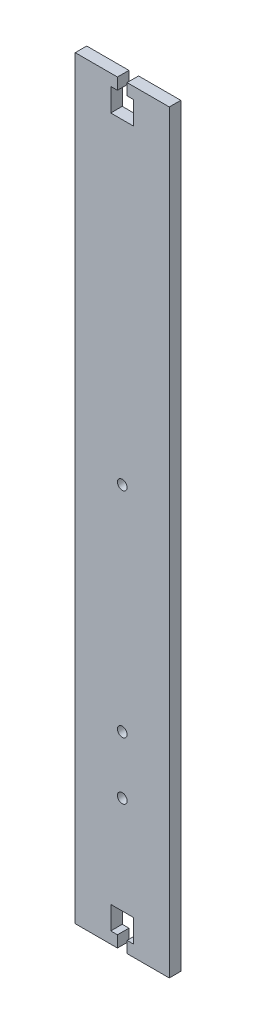
ISO-10303-21;
HEADER;
FILE_DESCRIPTION(('STEP AP214'),'2;1');
FILE_NAME('part.step','',(''),(''),'','','');
FILE_SCHEMA(('AUTOMOTIVE_DESIGN { 1 0 10303 214 1 1 1 1 }'));
ENDSEC;
DATA;
#1=APPLICATION_CONTEXT('core data for automotive mechanical design processes');
#2=APPLICATION_PROTOCOL_DEFINITION('international standard','automotive_design',2000,#1);
#3=PRODUCT_CONTEXT('',#1,'mechanical');
#4=PRODUCT('Part','Part','',(#3));
#5=PRODUCT_RELATED_PRODUCT_CATEGORY('part','',(#4));
#6=PRODUCT_DEFINITION_FORMATION('','',#4);
#7=PRODUCT_DEFINITION_CONTEXT('part definition',#1,'design');
#8=PRODUCT_DEFINITION('design','',#6,#7);
#9=PRODUCT_DEFINITION_SHAPE('','',#8);
#10=(LENGTH_UNIT() NAMED_UNIT(*) SI_UNIT(.MILLI.,.METRE.));
#11=(NAMED_UNIT(*) PLANE_ANGLE_UNIT() SI_UNIT($,.RADIAN.));
#12=(NAMED_UNIT(*) SI_UNIT($,.STERADIAN.) SOLID_ANGLE_UNIT());
#13=UNCERTAINTY_MEASURE_WITH_UNIT(LENGTH_MEASURE(1.E-05),#10,'distance_accuracy_value','');
#14=(GEOMETRIC_REPRESENTATION_CONTEXT(3) GLOBAL_UNCERTAINTY_ASSIGNED_CONTEXT((#13)) GLOBAL_UNIT_ASSIGNED_CONTEXT((#10,
#11,#12)) REPRESENTATION_CONTEXT('',''));
#15=CARTESIAN_POINT('',(0.,0.,0.));
#16=DIRECTION('',(0.,0.,1.));
#17=DIRECTION('',(1.,0.,0.));
#18=AXIS2_PLACEMENT_3D('',#15,#16,#17);
#19=CARTESIAN_POINT('',(20.445,-164.,5.));
#20=DIRECTION('',(0.,1.,0.));
#21=DIRECTION('',(0.,0.,1.));
#22=AXIS2_PLACEMENT_3D('',#19,#20,#21);
#23=PLANE('',#22);
#24=DIRECTION('',(1.,0.,0.));
#25=VECTOR('',#24,1.);
#26=CARTESIAN_POINT('',(20.445,-164.,0.));
#27=LINE('',#26,#25);
#28=CARTESIAN_POINT('',(-20.445,-164.,0.));
#29=VERTEX_POINT('',#28);
#30=CARTESIAN_POINT('',(-2.1,-164.,0.));
#31=VERTEX_POINT('',#30);
#32=EDGE_CURVE('E220',#29,#31,#27,.T.);
#33=ORIENTED_EDGE('',*,*,#32,.T.);
#34=DIRECTION('',(0.,0.,1.));
#35=VECTOR('',#34,1.);
#36=CARTESIAN_POINT('',(-2.1,-164.,-5.));
#37=LINE('',#36,#35);
#38=CARTESIAN_POINT('',(-2.1,-164.,5.));
#39=VERTEX_POINT('',#38);
#40=EDGE_CURVE('E292',#31,#39,#37,.T.);
#41=ORIENTED_EDGE('',*,*,#40,.T.);
#42=DIRECTION('',(1.,0.,0.));
#43=VECTOR('',#42,1.);
#44=CARTESIAN_POINT('',(20.445,-164.,5.));
#45=LINE('',#44,#43);
#46=CARTESIAN_POINT('',(-20.445,-164.,5.));
#47=VERTEX_POINT('',#46);
#48=EDGE_CURVE('E199',#47,#39,#45,.T.);
#49=ORIENTED_EDGE('',*,*,#48,.F.);
#50=DIRECTION('',(0.,0.,-1.));
#51=VECTOR('',#50,1.);
#52=CARTESIAN_POINT('',(-20.445,-164.,5.));
#53=LINE('',#52,#51);
#54=EDGE_CURVE('E234',#47,#29,#53,.T.);
#55=ORIENTED_EDGE('',*,*,#54,.T.);
#56=EDGE_LOOP('',(#33,#41,#49,#55));
#57=FACE_BOUND('',#56,.T.);
#58=ADVANCED_FACE('F37',(#57),#23,.F.);
#59=CARTESIAN_POINT('',(20.445,164.,5.));
#60=DIRECTION('',(0.,-1.,0.));
#61=DIRECTION('',(1.,0.,0.));
#62=AXIS2_PLACEMENT_3D('',#59,#60,#61);
#63=PLANE('',#62);
#64=DIRECTION('',(-1.,0.,0.));
#65=VECTOR('',#64,1.);
#66=CARTESIAN_POINT('',(20.445,164.,0.));
#67=LINE('',#66,#65);
#68=CARTESIAN_POINT('',(20.445,164.,0.));
#69=VERTEX_POINT('',#68);
#70=CARTESIAN_POINT('',(2.10000000000027,164.,0.));
#71=VERTEX_POINT('',#70);
#72=EDGE_CURVE('E205',#69,#71,#67,.T.);
#73=ORIENTED_EDGE('',*,*,#72,.T.);
#74=DIRECTION('',(0.,0.,1.));
#75=VECTOR('',#74,1.);
#76=CARTESIAN_POINT('',(2.10000000000027,164.,-5.));
#77=LINE('',#76,#75);
#78=CARTESIAN_POINT('',(2.10000000000027,164.,5.));
#79=VERTEX_POINT('',#78);
#80=EDGE_CURVE('E193',#71,#79,#77,.T.);
#81=ORIENTED_EDGE('',*,*,#80,.T.);
#82=DIRECTION('',(-1.,0.,0.));
#83=VECTOR('',#82,1.);
#84=CARTESIAN_POINT('',(20.445,164.,5.));
#85=LINE('',#84,#83);
#86=CARTESIAN_POINT('',(20.445,164.,5.));
#87=VERTEX_POINT('',#86);
#88=EDGE_CURVE('E211',#87,#79,#85,.T.);
#89=ORIENTED_EDGE('',*,*,#88,.F.);
#90=DIRECTION('',(0.,0.,-1.));
#91=VECTOR('',#90,1.);
#92=CARTESIAN_POINT('',(20.445,164.,5.));
#93=LINE('',#92,#91);
#94=EDGE_CURVE('E230',#87,#69,#93,.T.);
#95=ORIENTED_EDGE('',*,*,#94,.T.);
#96=EDGE_LOOP('',(#73,#81,#89,#95));
#97=FACE_BOUND('',#96,.T.);
#98=ADVANCED_FACE('F391',(#97),#63,.F.);
#99=CARTESIAN_POINT('',(-20.445,-164.,5.));
#100=DIRECTION('',(1.,0.,0.));
#101=DIRECTION('',(0.,0.,-1.));
#102=AXIS2_PLACEMENT_3D('',#99,#100,#101);
#103=PLANE('',#102);
#104=DIRECTION('',(0.,-1.,0.));
#105=VECTOR('',#104,1.);
#106=CARTESIAN_POINT('',(-20.445,-164.,0.));
#107=LINE('',#106,#105);
#108=CARTESIAN_POINT('',(-20.445,164.,0.));
#109=VERTEX_POINT('',#108);
#110=EDGE_CURVE('E215',#109,#29,#107,.T.);
#111=ORIENTED_EDGE('',*,*,#110,.T.);
#112=ORIENTED_EDGE('',*,*,#54,.F.);
#113=DIRECTION('',(0.,-1.,0.));
#114=VECTOR('',#113,1.);
#115=CARTESIAN_POINT('',(-20.445,-164.,5.));
#116=LINE('',#115,#114);
#117=CARTESIAN_POINT('',(-20.445,164.,5.));
#118=VERTEX_POINT('',#117);
#119=EDGE_CURVE('E200',#118,#47,#116,.T.);
#120=ORIENTED_EDGE('',*,*,#119,.F.);
#121=DIRECTION('',(0.,0.,-1.));
#122=VECTOR('',#121,1.);
#123=CARTESIAN_POINT('',(-20.445,164.,5.));
#124=LINE('',#123,#122);
#125=EDGE_CURVE('E214',#118,#109,#124,.T.);
#126=ORIENTED_EDGE('',*,*,#125,.T.);
#127=EDGE_LOOP('',(#111,#112,#120,#126));
#128=FACE_BOUND('',#127,.T.);
#129=ADVANCED_FACE('F39',(#128),#103,.F.);
#130=CARTESIAN_POINT('',(2.10000000000003,-164.,5.));
#131=VERTEX_POINT('',#130);
#132=CARTESIAN_POINT('',(20.445,-164.,5.));
#133=VERTEX_POINT('',#132);
#134=EDGE_CURVE('E188',#131,#133,#45,.T.);
#135=ORIENTED_EDGE('',*,*,#134,.F.);
#136=DIRECTION('',(0.,0.,1.));
#137=VECTOR('',#136,1.);
#138=CARTESIAN_POINT('',(2.10000000000003,-164.,-5.));
#139=LINE('',#138,#137);
#140=CARTESIAN_POINT('',(2.10000000000003,-164.,0.));
#141=VERTEX_POINT('',#140);
#142=EDGE_CURVE('E172',#141,#131,#139,.T.);
#143=ORIENTED_EDGE('',*,*,#142,.F.);
#144=CARTESIAN_POINT('',(20.445,-164.,0.));
#145=VERTEX_POINT('',#144);
#146=EDGE_CURVE('E218',#141,#145,#27,.T.);
#147=ORIENTED_EDGE('',*,*,#146,.T.);
#148=DIRECTION('',(0.,0.,-1.));
#149=VECTOR('',#148,1.);
#150=CARTESIAN_POINT('',(20.445,-164.,5.));
#151=LINE('',#150,#149);
#152=EDGE_CURVE('E197',#133,#145,#151,.T.);
#153=ORIENTED_EDGE('',*,*,#152,.F.);
#154=EDGE_LOOP('',(#135,#143,#147,#153));
#155=FACE_BOUND('',#154,.T.);
#156=ADVANCED_FACE('F195',(#155),#23,.F.);
#157=CARTESIAN_POINT('',(20.445,-164.,5.));
#158=DIRECTION('',(-1.,0.,0.));
#159=DIRECTION('',(0.,0.,1.));
#160=AXIS2_PLACEMENT_3D('',#157,#158,#159);
#161=PLANE('',#160);
#162=DIRECTION('',(0.,1.,0.));
#163=VECTOR('',#162,1.);
#164=CARTESIAN_POINT('',(20.445,-164.,0.));
#165=LINE('',#164,#163);
#166=EDGE_CURVE('E223',#145,#69,#165,.T.);
#167=ORIENTED_EDGE('',*,*,#166,.T.);
#168=ORIENTED_EDGE('',*,*,#94,.F.);
#169=DIRECTION('',(0.,1.,0.));
#170=VECTOR('',#169,1.);
#171=CARTESIAN_POINT('',(20.445,-164.,5.));
#172=LINE('',#171,#170);
#173=EDGE_CURVE('E203',#133,#87,#172,.T.);
#174=ORIENTED_EDGE('',*,*,#173,.F.);
#175=ORIENTED_EDGE('',*,*,#152,.T.);
#176=EDGE_LOOP('',(#167,#168,#174,#175));
#177=FACE_BOUND('',#176,.T.);
#178=ADVANCED_FACE('F400',(#177),#161,.F.);
#179=CARTESIAN_POINT('',(-2.09999999999976,164.,5.));
#180=VERTEX_POINT('',#179);
#181=EDGE_CURVE('E210',#180,#118,#85,.T.);
#182=ORIENTED_EDGE('',*,*,#181,.F.);
#183=DIRECTION('',(0.,0.,1.));
#184=VECTOR('',#183,1.);
#185=CARTESIAN_POINT('',(-2.09999999999976,164.,-5.));
#186=LINE('',#185,#184);
#187=CARTESIAN_POINT('',(-2.09999999999976,164.,0.));
#188=VERTEX_POINT('',#187);
#189=EDGE_CURVE('E322',#188,#180,#186,.T.);
#190=ORIENTED_EDGE('',*,*,#189,.F.);
#191=EDGE_CURVE('E225',#188,#109,#67,.T.);
#192=ORIENTED_EDGE('',*,*,#191,.T.);
#193=ORIENTED_EDGE('',*,*,#125,.F.);
#194=EDGE_LOOP('',(#182,#190,#192,#193));
#195=FACE_BOUND('',#194,.T.);
#196=ADVANCED_FACE('F376',(#195),#63,.F.);
#197=CARTESIAN_POINT('',(0.,0.,5.));
#198=DIRECTION('',(0.,0.,1.));
#199=DIRECTION('',(1.,0.,0.));
#200=AXIS2_PLACEMENT_3D('',#197,#198,#199);
#201=PLANE('',#200);
#202=CARTESIAN_POINT('',(0.,11.5000000000001,5.));
#203=DIRECTION('',(0.,0.,1.));
#204=DIRECTION('',(1.,0.,0.));
#205=AXIS2_PLACEMENT_3D('',#202,#203,#204);
#206=CIRCLE('',#205,2.1);
#207=CARTESIAN_POINT('',(2.10000000000001,11.5000000000001,5.));
#208=VERTEX_POINT('',#207);
#209=EDGE_CURVE('E359',#208,#208,#206,.T.);
#210=ORIENTED_EDGE('',*,*,#209,.F.);
#211=EDGE_LOOP('',(#210));
#212=FACE_BOUND('',#211,.T.);
#213=CARTESIAN_POINT('',(0.,-106.5,5.));
#214=DIRECTION('',(0.,0.,1.));
#215=DIRECTION('',(1.,0.,0.));
#216=AXIS2_PLACEMENT_3D('',#213,#214,#215);
#217=CIRCLE('',#216,2.1);
#218=CARTESIAN_POINT('',(2.10000000000002,-106.5,5.));
#219=VERTEX_POINT('',#218);
#220=EDGE_CURVE('E353',#219,#219,#217,.T.);
#221=ORIENTED_EDGE('',*,*,#220,.F.);
#222=EDGE_LOOP('',(#221));
#223=FACE_BOUND('',#222,.T.);
#224=DIRECTION('',(0.,-1.,0.));
#225=VECTOR('',#224,1.);
#226=CARTESIAN_POINT('',(-2.1,-164.,5.));
#227=LINE('',#226,#225);
#228=CARTESIAN_POINT('',(-2.1,-159.,5.));
#229=VERTEX_POINT('',#228);
#230=EDGE_CURVE('E182',#229,#39,#227,.T.);
#231=ORIENTED_EDGE('',*,*,#230,.F.);
#232=DIRECTION('',(1.,0.,0.));
#233=VECTOR('',#232,1.);
#234=CARTESIAN_POINT('',(-2.1,-159.,5.));
#235=LINE('',#234,#233);
#236=CARTESIAN_POINT('',(-5.,-159.,5.));
#237=VERTEX_POINT('',#236);
#238=EDGE_CURVE('E343',#237,#229,#235,.T.);
#239=ORIENTED_EDGE('',*,*,#238,.F.);
#240=DIRECTION('',(0.,-1.,0.));
#241=VECTOR('',#240,1.);
#242=CARTESIAN_POINT('',(-5.,-159.,5.));
#243=LINE('',#242,#241);
#244=CARTESIAN_POINT('',(-5.,-149.,5.));
#245=VERTEX_POINT('',#244);
#246=EDGE_CURVE('E288',#245,#237,#243,.T.);
#247=ORIENTED_EDGE('',*,*,#246,.F.);
#248=DIRECTION('',(-1.,0.,0.));
#249=VECTOR('',#248,1.);
#250=CARTESIAN_POINT('',(-5.,-149.,5.));
#251=LINE('',#250,#249);
#252=CARTESIAN_POINT('',(5.00000000000001,-149.,5.));
#253=VERTEX_POINT('',#252);
#254=EDGE_CURVE('E346',#253,#245,#251,.T.);
#255=ORIENTED_EDGE('',*,*,#254,.F.);
#256=DIRECTION('',(0.,1.,0.));
#257=VECTOR('',#256,1.);
#258=CARTESIAN_POINT('',(5.00000000000002,-159.,5.));
#259=LINE('',#258,#257);
#260=CARTESIAN_POINT('',(5.00000000000002,-159.,5.));
#261=VERTEX_POINT('',#260);
#262=EDGE_CURVE('E349',#261,#253,#259,.T.);
#263=ORIENTED_EDGE('',*,*,#262,.F.);
#264=DIRECTION('',(1.,0.,0.));
#265=VECTOR('',#264,1.);
#266=CARTESIAN_POINT('',(2.10000000000002,-159.,5.));
#267=LINE('',#266,#265);
#268=CARTESIAN_POINT('',(2.10000000000002,-159.,5.));
#269=VERTEX_POINT('',#268);
#270=EDGE_CURVE('E192',#269,#261,#267,.T.);
#271=ORIENTED_EDGE('',*,*,#270,.F.);
#272=DIRECTION('',(0.,1.,0.));
#273=VECTOR('',#272,1.);
#274=CARTESIAN_POINT('',(2.10000000000003,-164.,5.));
#275=LINE('',#274,#273);
#276=EDGE_CURVE('E175',#131,#269,#275,.T.);
#277=ORIENTED_EDGE('',*,*,#276,.F.);
#278=ORIENTED_EDGE('',*,*,#134,.T.);
#279=ORIENTED_EDGE('',*,*,#173,.T.);
#280=ORIENTED_EDGE('',*,*,#88,.T.);
#281=DIRECTION('',(0.,1.,0.));
#282=VECTOR('',#281,1.);
#283=CARTESIAN_POINT('',(2.10000000000027,164.,5.));
#284=LINE('',#283,#282);
#285=CARTESIAN_POINT('',(2.10000000000026,159.,5.));
#286=VERTEX_POINT('',#285);
#287=EDGE_CURVE('E320',#286,#79,#284,.T.);
#288=ORIENTED_EDGE('',*,*,#287,.F.);
#289=DIRECTION('',(-1.,0.,0.));
#290=VECTOR('',#289,1.);
#291=CARTESIAN_POINT('',(2.10000000000026,159.,5.));
#292=LINE('',#291,#290);
#293=CARTESIAN_POINT('',(5.00000000000026,159.,5.));
#294=VERTEX_POINT('',#293);
#295=EDGE_CURVE('E317',#294,#286,#292,.T.);
#296=ORIENTED_EDGE('',*,*,#295,.F.);
#297=DIRECTION('',(0.,1.,0.));
#298=VECTOR('',#297,1.);
#299=CARTESIAN_POINT('',(5.00000000000026,159.,5.));
#300=LINE('',#299,#298);
#301=CARTESIAN_POINT('',(5.00000000000024,149.,5.));
#302=VERTEX_POINT('',#301);
#303=EDGE_CURVE('E314',#302,#294,#300,.T.);
#304=ORIENTED_EDGE('',*,*,#303,.F.);
#305=DIRECTION('',(1.,0.,0.));
#306=VECTOR('',#305,1.);
#307=CARTESIAN_POINT('',(-4.99999999999978,149.,5.));
#308=LINE('',#307,#306);
#309=CARTESIAN_POINT('',(-4.99999999999978,149.,5.));
#310=VERTEX_POINT('',#309);
#311=EDGE_CURVE('E311',#310,#302,#308,.T.);
#312=ORIENTED_EDGE('',*,*,#311,.F.);
#313=DIRECTION('',(0.,-1.,0.));
#314=VECTOR('',#313,1.);
#315=CARTESIAN_POINT('',(-4.99999999999976,159.,5.));
#316=LINE('',#315,#314);
#317=CARTESIAN_POINT('',(-4.99999999999976,159.,5.));
#318=VERTEX_POINT('',#317);
#319=EDGE_CURVE('E308',#318,#310,#316,.T.);
#320=ORIENTED_EDGE('',*,*,#319,.F.);
#321=DIRECTION('',(-1.,0.,0.));
#322=VECTOR('',#321,1.);
#323=CARTESIAN_POINT('',(-2.09999999999976,159.,5.));
#324=LINE('',#323,#322);
#325=CARTESIAN_POINT('',(-2.09999999999976,159.,5.));
#326=VERTEX_POINT('',#325);
#327=EDGE_CURVE('E304',#326,#318,#324,.T.);
#328=ORIENTED_EDGE('',*,*,#327,.F.);
#329=DIRECTION('',(0.,-1.,0.));
#330=VECTOR('',#329,1.);
#331=CARTESIAN_POINT('',(-2.09999999999976,164.,5.));
#332=LINE('',#331,#330);
#333=EDGE_CURVE('E302',#180,#326,#332,.T.);
#334=ORIENTED_EDGE('',*,*,#333,.F.);
#335=ORIENTED_EDGE('',*,*,#181,.T.);
#336=ORIENTED_EDGE('',*,*,#119,.T.);
#337=ORIENTED_EDGE('',*,*,#48,.T.);
#338=EDGE_LOOP('',(#231,#239,#247,#255,#263,#271,#277,#278,#279,#280,#288,#296,#304,#312,#320,
#328,#334,#335,#336,#337));
#339=FACE_BOUND('',#338,.T.);
#340=CARTESIAN_POINT('',(0.,-81.5,5.));
#341=DIRECTION('',(0.,0.,1.));
#342=DIRECTION('',(1.,0.,0.));
#343=AXIS2_PLACEMENT_3D('',#340,#341,#342);
#344=CIRCLE('',#343,2.1);
#345=CARTESIAN_POINT('',(2.10000000000002,-81.5,5.));
#346=VERTEX_POINT('',#345);
#347=EDGE_CURVE('E240',#346,#346,#344,.T.);
#348=ORIENTED_EDGE('',*,*,#347,.F.);
#349=EDGE_LOOP('',(#348));
#350=FACE_BOUND('',#349,.T.);
#351=ADVANCED_FACE('F186',(#212,#223,#339,#350),#201,.T.);
#352=CARTESIAN_POINT('',(0.,0.,0.));
#353=DIRECTION('',(0.,0.,1.));
#354=DIRECTION('',(1.,0.,0.));
#355=AXIS2_PLACEMENT_3D('',#352,#353,#354);
#356=PLANE('',#355);
#357=CARTESIAN_POINT('',(0.,11.5000000000001,0.));
#358=DIRECTION('',(0.,0.,1.));
#359=DIRECTION('',(1.,0.,0.));
#360=AXIS2_PLACEMENT_3D('',#357,#358,#359);
#361=CIRCLE('',#360,2.1);
#362=CARTESIAN_POINT('',(2.10000000000001,11.5000000000001,0.));
#363=VERTEX_POINT('',#362);
#364=EDGE_CURVE('E356',#363,#363,#361,.T.);
#365=ORIENTED_EDGE('',*,*,#364,.T.);
#366=EDGE_LOOP('',(#365));
#367=FACE_BOUND('',#366,.T.);
#368=CARTESIAN_POINT('',(0.,-106.5,0.));
#369=DIRECTION('',(0.,0.,1.));
#370=DIRECTION('',(1.,0.,0.));
#371=AXIS2_PLACEMENT_3D('',#368,#369,#370);
#372=CIRCLE('',#371,2.1);
#373=CARTESIAN_POINT('',(2.10000000000002,-106.5,0.));
#374=VERTEX_POINT('',#373);
#375=EDGE_CURVE('E305',#374,#374,#372,.T.);
#376=ORIENTED_EDGE('',*,*,#375,.T.);
#377=EDGE_LOOP('',(#376));
#378=FACE_BOUND('',#377,.T.);
#379=CARTESIAN_POINT('',(0.,-81.5,0.));
#380=DIRECTION('',(0.,0.,1.));
#381=DIRECTION('',(1.,0.,0.));
#382=AXIS2_PLACEMENT_3D('',#379,#380,#381);
#383=CIRCLE('',#382,2.1);
#384=CARTESIAN_POINT('',(2.10000000000002,-81.5,0.));
#385=VERTEX_POINT('',#384);
#386=EDGE_CURVE('E219',#385,#385,#383,.T.);
#387=ORIENTED_EDGE('',*,*,#386,.T.);
#388=EDGE_LOOP('',(#387));
#389=FACE_BOUND('',#388,.T.);
#390=DIRECTION('',(1.,0.,0.));
#391=VECTOR('',#390,1.);
#392=CARTESIAN_POINT('',(0.,-159.,0.));
#393=LINE('',#392,#391);
#394=CARTESIAN_POINT('',(-5.,-159.,0.));
#395=VERTEX_POINT('',#394);
#396=CARTESIAN_POINT('',(-2.1,-159.,0.));
#397=VERTEX_POINT('',#396);
#398=EDGE_CURVE('E45',#395,#397,#393,.T.);
#399=ORIENTED_EDGE('',*,*,#398,.T.);
#400=DIRECTION('',(0.,-1.,0.));
#401=VECTOR('',#400,1.);
#402=CARTESIAN_POINT('',(-2.1,0.,0.));
#403=LINE('',#402,#401);
#404=EDGE_CURVE('E11',#397,#31,#403,.T.);
#405=ORIENTED_EDGE('',*,*,#404,.T.);
#406=ORIENTED_EDGE('',*,*,#32,.F.);
#407=ORIENTED_EDGE('',*,*,#110,.F.);
#408=ORIENTED_EDGE('',*,*,#191,.F.);
#409=DIRECTION('',(0.,-1.,0.));
#410=VECTOR('',#409,1.);
#411=CARTESIAN_POINT('',(-2.09999999999998,0.,0.));
#412=LINE('',#411,#410);
#413=CARTESIAN_POINT('',(-2.09999999999976,159.,0.));
#414=VERTEX_POINT('',#413);
#415=EDGE_CURVE('E237',#188,#414,#412,.T.);
#416=ORIENTED_EDGE('',*,*,#415,.T.);
#417=DIRECTION('',(-1.,0.,0.));
#418=VECTOR('',#417,1.);
#419=CARTESIAN_POINT('',(0.,159.,0.));
#420=LINE('',#419,#418);
#421=CARTESIAN_POINT('',(-4.99999999999976,159.,0.));
#422=VERTEX_POINT('',#421);
#423=EDGE_CURVE('E243',#414,#422,#420,.T.);
#424=ORIENTED_EDGE('',*,*,#423,.T.);
#425=DIRECTION('',(0.,-1.,0.));
#426=VECTOR('',#425,1.);
#427=CARTESIAN_POINT('',(-4.99999999999998,0.,0.));
#428=LINE('',#427,#426);
#429=CARTESIAN_POINT('',(-4.99999999999978,149.,0.));
#430=VERTEX_POINT('',#429);
#431=EDGE_CURVE('E246',#422,#430,#428,.T.);
#432=ORIENTED_EDGE('',*,*,#431,.T.);
#433=DIRECTION('',(1.,0.,0.));
#434=VECTOR('',#433,1.);
#435=CARTESIAN_POINT('',(8.2711615334574E-13,149.,0.));
#436=LINE('',#435,#434);
#437=CARTESIAN_POINT('',(5.00000000000024,149.,0.));
#438=VERTEX_POINT('',#437);
#439=EDGE_CURVE('E249',#430,#438,#436,.T.);
#440=ORIENTED_EDGE('',*,*,#439,.T.);
#441=DIRECTION('',(0.,1.,0.));
#442=VECTOR('',#441,1.);
#443=CARTESIAN_POINT('',(4.9999999999999,0.,0.));
#444=LINE('',#443,#442);
#445=CARTESIAN_POINT('',(5.00000000000026,159.,0.));
#446=VERTEX_POINT('',#445);
#447=EDGE_CURVE('E252',#438,#446,#444,.T.);
#448=ORIENTED_EDGE('',*,*,#447,.T.);
#449=DIRECTION('',(-1.,0.,0.));
#450=VECTOR('',#449,1.);
#451=CARTESIAN_POINT('',(0.,159.,0.));
#452=LINE('',#451,#450);
#453=CARTESIAN_POINT('',(2.10000000000026,159.,0.));
#454=VERTEX_POINT('',#453);
#455=EDGE_CURVE('E255',#446,#454,#452,.T.);
#456=ORIENTED_EDGE('',*,*,#455,.T.);
#457=DIRECTION('',(0.,1.,0.));
#458=VECTOR('',#457,1.);
#459=CARTESIAN_POINT('',(2.0999999999999,0.,0.));
#460=LINE('',#459,#458);
#461=EDGE_CURVE('E258',#454,#71,#460,.T.);
#462=ORIENTED_EDGE('',*,*,#461,.T.);
#463=ORIENTED_EDGE('',*,*,#72,.F.);
#464=ORIENTED_EDGE('',*,*,#166,.F.);
#465=ORIENTED_EDGE('',*,*,#146,.F.);
#466=DIRECTION('',(0.,1.,0.));
#467=VECTOR('',#466,1.);
#468=CARTESIAN_POINT('',(2.09999999999989,0.,0.));
#469=LINE('',#468,#467);
#470=CARTESIAN_POINT('',(2.10000000000002,-159.,0.));
#471=VERTEX_POINT('',#470);
#472=EDGE_CURVE('E178',#141,#471,#469,.T.);
#473=ORIENTED_EDGE('',*,*,#472,.T.);
#474=DIRECTION('',(1.,0.,0.));
#475=VECTOR('',#474,1.);
#476=CARTESIAN_POINT('',(0.,-159.,0.));
#477=LINE('',#476,#475);
#478=CARTESIAN_POINT('',(5.00000000000002,-159.,0.));
#479=VERTEX_POINT('',#478);
#480=EDGE_CURVE('E262',#471,#479,#477,.T.);
#481=ORIENTED_EDGE('',*,*,#480,.T.);
#482=DIRECTION('',(0.,1.,0.));
#483=VECTOR('',#482,1.);
#484=CARTESIAN_POINT('',(4.99999999999988,0.,0.));
#485=LINE('',#484,#483);
#486=CARTESIAN_POINT('',(5.00000000000001,-149.,0.));
#487=VERTEX_POINT('',#486);
#488=EDGE_CURVE('E265',#479,#487,#485,.T.);
#489=ORIENTED_EDGE('',*,*,#488,.T.);
#490=DIRECTION('',(-1.,0.,0.));
#491=VECTOR('',#490,1.);
#492=CARTESIAN_POINT('',(0.,-149.,0.));
#493=LINE('',#492,#491);
#494=CARTESIAN_POINT('',(-5.,-149.,0.));
#495=VERTEX_POINT('',#494);
#496=EDGE_CURVE('E268',#487,#495,#493,.T.);
#497=ORIENTED_EDGE('',*,*,#496,.T.);
#498=DIRECTION('',(0.,-1.,0.));
#499=VECTOR('',#498,1.);
#500=CARTESIAN_POINT('',(-5.,0.,0.));
#501=LINE('',#500,#499);
#502=EDGE_CURVE('E271',#495,#395,#501,.T.);
#503=ORIENTED_EDGE('',*,*,#502,.T.);
#504=EDGE_LOOP('',(#399,#405,#406,#407,#408,#416,#424,#432,#440,#448,#456,#462,#463,#464,#465,
#473,#481,#489,#497,#503));
#505=FACE_BOUND('',#504,.T.);
#506=ADVANCED_FACE('F275',(#367,#378,#389,#505),#356,.F.);
#507=CARTESIAN_POINT('',(0.,-81.5,-5.));
#508=DIRECTION('',(0.,0.,1.));
#509=DIRECTION('',(1.,0.,0.));
#510=AXIS2_PLACEMENT_3D('',#507,#508,#509);
#511=CYLINDRICAL_SURFACE('',#510,2.1);
#512=ORIENTED_EDGE('',*,*,#347,.T.);
#513=EDGE_LOOP('',(#512));
#514=FACE_BOUND('',#513,.T.);
#515=ORIENTED_EDGE('',*,*,#386,.F.);
#516=EDGE_LOOP('',(#515));
#517=FACE_BOUND('',#516,.T.);
#518=ADVANCED_FACE('F475',(#514,#517),#511,.F.);
#519=CARTESIAN_POINT('',(2.10000000000027,164.,-5.));
#520=DIRECTION('',(1.,0.,0.));
#521=DIRECTION('',(0.,1.,0.));
#522=AXIS2_PLACEMENT_3D('',#519,#520,#521);
#523=PLANE('',#522);
#524=DIRECTION('',(0.,0.,1.));
#525=VECTOR('',#524,1.);
#526=CARTESIAN_POINT('',(2.10000000000026,159.,-5.));
#527=LINE('',#526,#525);
#528=EDGE_CURVE('E325',#454,#286,#527,.T.);
#529=ORIENTED_EDGE('',*,*,#528,.T.);
#530=ORIENTED_EDGE('',*,*,#287,.T.);
#531=ORIENTED_EDGE('',*,*,#80,.F.);
#532=ORIENTED_EDGE('',*,*,#461,.F.);
#533=EDGE_LOOP('',(#529,#530,#531,#532));
#534=FACE_BOUND('',#533,.T.);
#535=ADVANCED_FACE('F442',(#534),#523,.F.);
#536=CARTESIAN_POINT('',(2.10000000000026,159.,-5.));
#537=DIRECTION('',(0.,1.,0.));
#538=DIRECTION('',(0.,0.,1.));
#539=AXIS2_PLACEMENT_3D('',#536,#537,#538);
#540=PLANE('',#539);
#541=DIRECTION('',(0.,0.,1.));
#542=VECTOR('',#541,1.);
#543=CARTESIAN_POINT('',(5.00000000000026,159.,-5.));
#544=LINE('',#543,#542);
#545=EDGE_CURVE('E327',#446,#294,#544,.T.);
#546=ORIENTED_EDGE('',*,*,#545,.T.);
#547=ORIENTED_EDGE('',*,*,#295,.T.);
#548=ORIENTED_EDGE('',*,*,#528,.F.);
#549=ORIENTED_EDGE('',*,*,#455,.F.);
#550=EDGE_LOOP('',(#546,#547,#548,#549));
#551=FACE_BOUND('',#550,.T.);
#552=ADVANCED_FACE('F438',(#551),#540,.F.);
#553=CARTESIAN_POINT('',(5.00000000000026,159.,-5.));
#554=DIRECTION('',(1.,0.,0.));
#555=DIRECTION('',(0.,1.,0.));
#556=AXIS2_PLACEMENT_3D('',#553,#554,#555);
#557=PLANE('',#556);
#558=DIRECTION('',(0.,0.,1.));
#559=VECTOR('',#558,1.);
#560=CARTESIAN_POINT('',(5.00000000000024,149.,-5.));
#561=LINE('',#560,#559);
#562=EDGE_CURVE('E329',#438,#302,#561,.T.);
#563=ORIENTED_EDGE('',*,*,#562,.T.);
#564=ORIENTED_EDGE('',*,*,#303,.T.);
#565=ORIENTED_EDGE('',*,*,#545,.F.);
#566=ORIENTED_EDGE('',*,*,#447,.F.);
#567=EDGE_LOOP('',(#563,#564,#565,#566));
#568=FACE_BOUND('',#567,.T.);
#569=ADVANCED_FACE('F435',(#568),#557,.F.);
#570=CARTESIAN_POINT('',(-4.99999999999978,149.,-5.));
#571=DIRECTION('',(0.,-1.,0.));
#572=DIRECTION('',(1.,0.,0.));
#573=AXIS2_PLACEMENT_3D('',#570,#571,#572);
#574=PLANE('',#573);
#575=DIRECTION('',(0.,0.,1.));
#576=VECTOR('',#575,1.);
#577=CARTESIAN_POINT('',(-4.99999999999978,149.,-5.));
#578=LINE('',#577,#576);
#579=EDGE_CURVE('E331',#430,#310,#578,.T.);
#580=ORIENTED_EDGE('',*,*,#579,.T.);
#581=ORIENTED_EDGE('',*,*,#311,.T.);
#582=ORIENTED_EDGE('',*,*,#562,.F.);
#583=ORIENTED_EDGE('',*,*,#439,.F.);
#584=EDGE_LOOP('',(#580,#581,#582,#583));
#585=FACE_BOUND('',#584,.T.);
#586=ADVANCED_FACE('F430',(#585),#574,.F.);
#587=CARTESIAN_POINT('',(-4.99999999999976,159.,-5.));
#588=DIRECTION('',(-1.,0.,0.));
#589=DIRECTION('',(0.,-1.,0.));
#590=AXIS2_PLACEMENT_3D('',#587,#588,#589);
#591=PLANE('',#590);
#592=DIRECTION('',(0.,0.,1.));
#593=VECTOR('',#592,1.);
#594=CARTESIAN_POINT('',(-4.99999999999976,159.,-5.));
#595=LINE('',#594,#593);
#596=EDGE_CURVE('E333',#422,#318,#595,.T.);
#597=ORIENTED_EDGE('',*,*,#596,.T.);
#598=ORIENTED_EDGE('',*,*,#319,.T.);
#599=ORIENTED_EDGE('',*,*,#579,.F.);
#600=ORIENTED_EDGE('',*,*,#431,.F.);
#601=EDGE_LOOP('',(#597,#598,#599,#600));
#602=FACE_BOUND('',#601,.T.);
#603=ADVANCED_FACE('F426',(#602),#591,.F.);
#604=CARTESIAN_POINT('',(-2.09999999999976,159.,-5.));
#605=DIRECTION('',(0.,1.,0.));
#606=DIRECTION('',(0.,0.,1.));
#607=AXIS2_PLACEMENT_3D('',#604,#605,#606);
#608=PLANE('',#607);
#609=DIRECTION('',(0.,0.,1.));
#610=VECTOR('',#609,1.);
#611=CARTESIAN_POINT('',(-2.09999999999976,159.,-5.));
#612=LINE('',#611,#610);
#613=EDGE_CURVE('E60',#414,#326,#612,.T.);
#614=ORIENTED_EDGE('',*,*,#613,.T.);
#615=ORIENTED_EDGE('',*,*,#327,.T.);
#616=ORIENTED_EDGE('',*,*,#596,.F.);
#617=ORIENTED_EDGE('',*,*,#423,.F.);
#618=EDGE_LOOP('',(#614,#615,#616,#617));
#619=FACE_BOUND('',#618,.T.);
#620=ADVANCED_FACE('F423',(#619),#608,.F.);
#621=CARTESIAN_POINT('',(-2.09999999999976,164.,-5.));
#622=DIRECTION('',(-1.,0.,0.));
#623=DIRECTION('',(0.,-1.,0.));
#624=AXIS2_PLACEMENT_3D('',#621,#622,#623);
#625=PLANE('',#624);
#626=ORIENTED_EDGE('',*,*,#189,.T.);
#627=ORIENTED_EDGE('',*,*,#333,.T.);
#628=ORIENTED_EDGE('',*,*,#613,.F.);
#629=ORIENTED_EDGE('',*,*,#415,.F.);
#630=EDGE_LOOP('',(#626,#627,#628,#629));
#631=FACE_BOUND('',#630,.T.);
#632=ADVANCED_FACE('F420',(#631),#625,.F.);
#633=CARTESIAN_POINT('',(-2.1,-164.,-5.));
#634=DIRECTION('',(-1.,0.,0.));
#635=DIRECTION('',(0.,0.,1.));
#636=AXIS2_PLACEMENT_3D('',#633,#634,#635);
#637=PLANE('',#636);
#638=DIRECTION('',(0.,0.,1.));
#639=VECTOR('',#638,1.);
#640=CARTESIAN_POINT('',(-2.1,-159.,-5.));
#641=LINE('',#640,#639);
#642=EDGE_CURVE('E283',#397,#229,#641,.T.);
#643=ORIENTED_EDGE('',*,*,#642,.T.);
#644=ORIENTED_EDGE('',*,*,#230,.T.);
#645=ORIENTED_EDGE('',*,*,#40,.F.);
#646=ORIENTED_EDGE('',*,*,#404,.F.);
#647=EDGE_LOOP('',(#643,#644,#645,#646));
#648=FACE_BOUND('',#647,.T.);
#649=ADVANCED_FACE('F456',(#648),#637,.F.);
#650=CARTESIAN_POINT('',(-2.1,-159.,-5.));
#651=DIRECTION('',(0.,-1.,0.));
#652=DIRECTION('',(0.,0.,-1.));
#653=AXIS2_PLACEMENT_3D('',#650,#651,#652);
#654=PLANE('',#653);
#655=DIRECTION('',(0.,0.,1.));
#656=VECTOR('',#655,1.);
#657=CARTESIAN_POINT('',(-5.,-159.,-5.));
#658=LINE('',#657,#656);
#659=EDGE_CURVE('E281',#395,#237,#658,.T.);
#660=ORIENTED_EDGE('',*,*,#659,.T.);
#661=ORIENTED_EDGE('',*,*,#238,.T.);
#662=ORIENTED_EDGE('',*,*,#642,.F.);
#663=ORIENTED_EDGE('',*,*,#398,.F.);
#664=EDGE_LOOP('',(#660,#661,#662,#663));
#665=FACE_BOUND('',#664,.T.);
#666=ADVANCED_FACE('F279',(#665),#654,.F.);
#667=CARTESIAN_POINT('',(-5.,-159.,-5.));
#668=DIRECTION('',(-1.,0.,0.));
#669=DIRECTION('',(0.,0.,1.));
#670=AXIS2_PLACEMENT_3D('',#667,#668,#669);
#671=PLANE('',#670);
#672=DIRECTION('',(0.,0.,1.));
#673=VECTOR('',#672,1.);
#674=CARTESIAN_POINT('',(-5.,-149.,-5.));
#675=LINE('',#674,#673);
#676=EDGE_CURVE('E290',#495,#245,#675,.T.);
#677=ORIENTED_EDGE('',*,*,#676,.T.);
#678=ORIENTED_EDGE('',*,*,#246,.T.);
#679=ORIENTED_EDGE('',*,*,#659,.F.);
#680=ORIENTED_EDGE('',*,*,#502,.F.);
#681=EDGE_LOOP('',(#677,#678,#679,#680));
#682=FACE_BOUND('',#681,.T.);
#683=ADVANCED_FACE('F285',(#682),#671,.F.);
#684=CARTESIAN_POINT('',(-5.,-149.,-5.));
#685=DIRECTION('',(0.,1.,0.));
#686=DIRECTION('',(0.,0.,1.));
#687=AXIS2_PLACEMENT_3D('',#684,#685,#686);
#688=PLANE('',#687);
#689=DIRECTION('',(0.,0.,1.));
#690=VECTOR('',#689,1.);
#691=CARTESIAN_POINT('',(5.00000000000001,-149.,-5.));
#692=LINE('',#691,#690);
#693=EDGE_CURVE('E294',#487,#253,#692,.T.);
#694=ORIENTED_EDGE('',*,*,#693,.T.);
#695=ORIENTED_EDGE('',*,*,#254,.T.);
#696=ORIENTED_EDGE('',*,*,#676,.F.);
#697=ORIENTED_EDGE('',*,*,#496,.F.);
#698=EDGE_LOOP('',(#694,#695,#696,#697));
#699=FACE_BOUND('',#698,.T.);
#700=ADVANCED_FACE('F454',(#699),#688,.F.);
#701=CARTESIAN_POINT('',(5.00000000000002,-159.,-5.));
#702=DIRECTION('',(1.,0.,0.));
#703=DIRECTION('',(0.,1.,0.));
#704=AXIS2_PLACEMENT_3D('',#701,#702,#703);
#705=PLANE('',#704);
#706=DIRECTION('',(0.,0.,1.));
#707=VECTOR('',#706,1.);
#708=CARTESIAN_POINT('',(5.00000000000002,-159.,-5.));
#709=LINE('',#708,#707);
#710=EDGE_CURVE('E299',#479,#261,#709,.T.);
#711=ORIENTED_EDGE('',*,*,#710,.T.);
#712=ORIENTED_EDGE('',*,*,#262,.T.);
#713=ORIENTED_EDGE('',*,*,#693,.F.);
#714=ORIENTED_EDGE('',*,*,#488,.F.);
#715=EDGE_LOOP('',(#711,#712,#713,#714));
#716=FACE_BOUND('',#715,.T.);
#717=ADVANCED_FACE('F450',(#716),#705,.F.);
#718=CARTESIAN_POINT('',(2.10000000000002,-159.,-5.));
#719=DIRECTION('',(0.,-1.,0.));
#720=DIRECTION('',(0.,0.,-1.));
#721=AXIS2_PLACEMENT_3D('',#718,#719,#720);
#722=PLANE('',#721);
#723=DIRECTION('',(0.,0.,1.));
#724=VECTOR('',#723,1.);
#725=CARTESIAN_POINT('',(2.10000000000002,-159.,-5.));
#726=LINE('',#725,#724);
#727=EDGE_CURVE('E52',#471,#269,#726,.T.);
#728=ORIENTED_EDGE('',*,*,#727,.T.);
#729=ORIENTED_EDGE('',*,*,#270,.T.);
#730=ORIENTED_EDGE('',*,*,#710,.F.);
#731=ORIENTED_EDGE('',*,*,#480,.F.);
#732=EDGE_LOOP('',(#728,#729,#730,#731));
#733=FACE_BOUND('',#732,.T.);
#734=ADVANCED_FACE('F386',(#733),#722,.F.);
#735=CARTESIAN_POINT('',(2.10000000000003,-164.,-5.));
#736=DIRECTION('',(1.,0.,0.));
#737=DIRECTION('',(0.,1.,0.));
#738=AXIS2_PLACEMENT_3D('',#735,#736,#737);
#739=PLANE('',#738);
#740=ORIENTED_EDGE('',*,*,#142,.T.);
#741=ORIENTED_EDGE('',*,*,#276,.T.);
#742=ORIENTED_EDGE('',*,*,#727,.F.);
#743=ORIENTED_EDGE('',*,*,#472,.F.);
#744=EDGE_LOOP('',(#740,#741,#742,#743));
#745=FACE_BOUND('',#744,.T.);
#746=ADVANCED_FACE('F174',(#745),#739,.F.);
#747=CARTESIAN_POINT('',(0.,-106.5,0.));
#748=DIRECTION('',(0.,0.,1.));
#749=DIRECTION('',(1.,0.,0.));
#750=AXIS2_PLACEMENT_3D('',#747,#748,#749);
#751=CYLINDRICAL_SURFACE('',#750,2.1);
#752=ORIENTED_EDGE('',*,*,#375,.F.);
#753=EDGE_LOOP('',(#752));
#754=FACE_BOUND('',#753,.T.);
#755=ORIENTED_EDGE('',*,*,#220,.T.);
#756=EDGE_LOOP('',(#755));
#757=FACE_BOUND('',#756,.T.);
#758=ADVANCED_FACE('F370',(#754,#757),#751,.F.);
#759=CARTESIAN_POINT('',(0.,11.5000000000001,0.));
#760=DIRECTION('',(0.,0.,1.));
#761=DIRECTION('',(1.,0.,0.));
#762=AXIS2_PLACEMENT_3D('',#759,#760,#761);
#763=CYLINDRICAL_SURFACE('',#762,2.1);
#764=ORIENTED_EDGE('',*,*,#364,.F.);
#765=EDGE_LOOP('',(#764));
#766=FACE_BOUND('',#765,.T.);
#767=ORIENTED_EDGE('',*,*,#209,.T.);
#768=EDGE_LOOP('',(#767));
#769=FACE_BOUND('',#768,.T.);
#770=ADVANCED_FACE('F367',(#766,#769),#763,.F.);
#771=CLOSED_SHELL('',(#58,#98,#129,#156,#178,#196,#351,#506,#518,#535,#552,#569,#586,#603,#620,
#632,#649,#666,#683,#700,#717,#734,#746,#758,#770));
#772=MANIFOLD_SOLID_BREP('B2',#771);
#773=ADVANCED_BREP_SHAPE_REPRESENTATION('',(#18,#772),#14);
#774=SHAPE_DEFINITION_REPRESENTATION(#9,#773);
ENDSEC;
END-ISO-10303-21;
